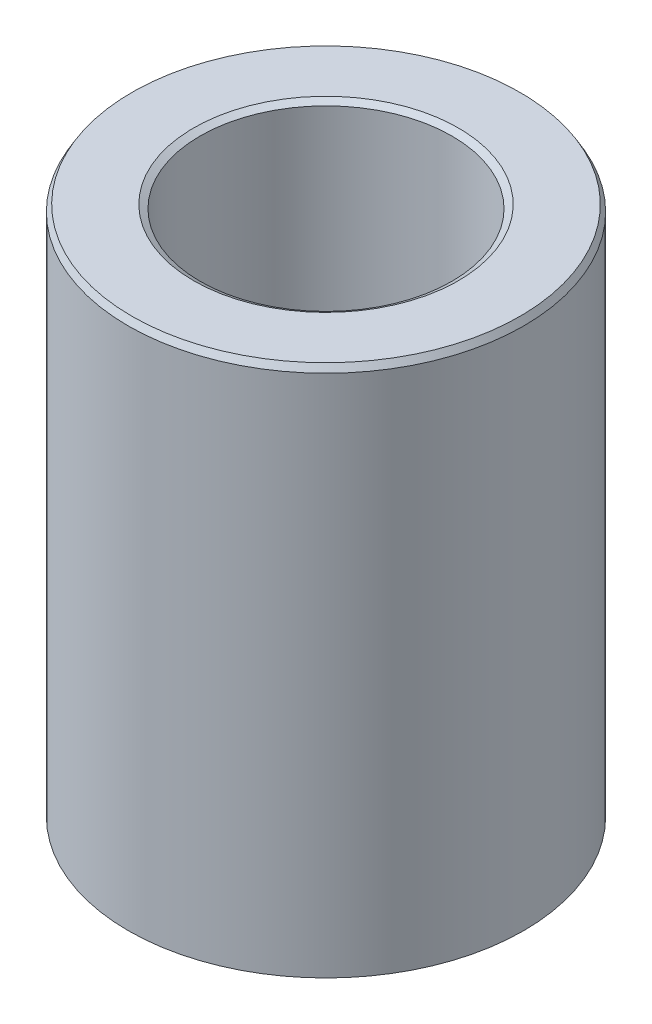
ISO-10303-21;
HEADER;
FILE_DESCRIPTION(('STEP AP214'),'2;1');
FILE_NAME('part.step','',(''),(''),'','','');
FILE_SCHEMA(('AUTOMOTIVE_DESIGN { 1 0 10303 214 1 1 1 1 }'));
ENDSEC;
DATA;
#1=APPLICATION_CONTEXT('core data for automotive mechanical design processes');
#2=APPLICATION_PROTOCOL_DEFINITION('international standard','automotive_design',2000,#1);
#3=PRODUCT_CONTEXT('',#1,'mechanical');
#4=PRODUCT('Part','Part','',(#3));
#5=PRODUCT_RELATED_PRODUCT_CATEGORY('part','',(#4));
#6=PRODUCT_DEFINITION_FORMATION('','',#4);
#7=PRODUCT_DEFINITION_CONTEXT('part definition',#1,'design');
#8=PRODUCT_DEFINITION('design','',#6,#7);
#9=PRODUCT_DEFINITION_SHAPE('','',#8);
#10=(LENGTH_UNIT() NAMED_UNIT(*) SI_UNIT(.MILLI.,.METRE.));
#11=(NAMED_UNIT(*) PLANE_ANGLE_UNIT() SI_UNIT($,.RADIAN.));
#12=(NAMED_UNIT(*) SI_UNIT($,.STERADIAN.) SOLID_ANGLE_UNIT());
#13=UNCERTAINTY_MEASURE_WITH_UNIT(LENGTH_MEASURE(1.E-05),#10,'distance_accuracy_value','');
#14=(GEOMETRIC_REPRESENTATION_CONTEXT(3) GLOBAL_UNCERTAINTY_ASSIGNED_CONTEXT((#13)) GLOBAL_UNIT_ASSIGNED_CONTEXT((#10,
#11,#12)) REPRESENTATION_CONTEXT('',''));
#15=CARTESIAN_POINT('',(0.,0.,0.));
#16=DIRECTION('',(0.,0.,1.));
#17=DIRECTION('',(1.,0.,0.));
#18=AXIS2_PLACEMENT_3D('',#15,#16,#17);
#19=CARTESIAN_POINT('',(0.,155.263865833454,0.));
#20=DIRECTION('',(0.,-1.,0.));
#21=DIRECTION('',(0.,0.,-1.));
#22=AXIS2_PLACEMENT_3D('',#19,#20,#21);
#23=CYLINDRICAL_SURFACE('',#22,57.5);
#24=CARTESIAN_POINT('',(0.,1.08624945352614,0.));
#25=DIRECTION('',(0.,1.,0.));
#26=DIRECTION('',(0.,0.,1.));
#27=AXIS2_PLACEMENT_3D('',#24,#25,#26);
#28=CIRCLE('',#27,57.5);
#29=CARTESIAN_POINT('',(0.,1.08624945352614,57.5));
#30=VERTEX_POINT('',#29);
#31=EDGE_CURVE('E10',#30,#30,#28,.T.);
#32=ORIENTED_EDGE('',*,*,#31,.T.);
#33=EDGE_LOOP('',(#32));
#34=FACE_BOUND('',#33,.T.);
#35=CARTESIAN_POINT('',(0.,153.382426590253,0.));
#36=DIRECTION('',(0.,1.,0.));
#37=DIRECTION('',(0.,0.,1.));
#38=AXIS2_PLACEMENT_3D('',#35,#36,#37);
#39=CIRCLE('',#38,57.5);
#40=CARTESIAN_POINT('',(0.,153.382426590253,57.5));
#41=VERTEX_POINT('',#40);
#42=EDGE_CURVE('E50',#41,#41,#39,.F.);
#43=ORIENTED_EDGE('',*,*,#42,.T.);
#44=EDGE_LOOP('',(#43));
#45=FACE_BOUND('',#44,.T.);
#46=ADVANCED_FACE('F39',(#34,#45),#23,.T.);
#47=CARTESIAN_POINT('',(0.,155.263865833454,0.));
#48=DIRECTION('',(0.,1.,0.));
#49=DIRECTION('',(0.,0.,1.));
#50=AXIS2_PLACEMENT_3D('',#47,#48,#49);
#51=PLANE('',#50);
#52=CARTESIAN_POINT('',(0.,155.263865833454,0.));
#53=DIRECTION('',(0.,1.,0.));
#54=DIRECTION('',(0.,0.,1.));
#55=AXIS2_PLACEMENT_3D('',#52,#53,#54);
#56=CIRCLE('',#55,38.4941172316721);
#57=CARTESIAN_POINT('',(0.,155.263865833454,38.4941172316721));
#58=VERTEX_POINT('',#57);
#59=EDGE_CURVE('E58',#58,#58,#56,.F.);
#60=ORIENTED_EDGE('',*,*,#59,.T.);
#61=EDGE_LOOP('',(#60));
#62=FACE_BOUND('',#61,.T.);
#63=CARTESIAN_POINT('',(0.,155.263865833454,0.));
#64=DIRECTION('',(0.,1.,0.));
#65=DIRECTION('',(0.,0.,1.));
#66=AXIS2_PLACEMENT_3D('',#63,#64,#65);
#67=CIRCLE('',#66,56.4137505464739);
#68=CARTESIAN_POINT('',(0.,155.263865833454,56.4137505464739));
#69=VERTEX_POINT('',#68);
#70=EDGE_CURVE('E61',#69,#69,#67,.T.);
#71=ORIENTED_EDGE('',*,*,#70,.T.);
#72=EDGE_LOOP('',(#71));
#73=FACE_BOUND('',#72,.T.);
#74=ADVANCED_FACE('F88',(#62,#73),#51,.T.);
#75=CARTESIAN_POINT('',(0.,0.,0.));
#76=DIRECTION('',(0.,1.,0.));
#77=DIRECTION('',(0.,0.,1.));
#78=AXIS2_PLACEMENT_3D('',#75,#76,#77);
#79=PLANE('',#78);
#80=CARTESIAN_POINT('',(0.,0.,0.));
#81=DIRECTION('',(0.,1.,0.));
#82=DIRECTION('',(0.,0.,1.));
#83=AXIS2_PLACEMENT_3D('',#80,#81,#82);
#84=CIRCLE('',#83,37.6989274419969);
#85=CARTESIAN_POINT('',(0.,0.,37.6989274419969));
#86=VERTEX_POINT('',#85);
#87=EDGE_CURVE('E51',#86,#86,#84,.T.);
#88=ORIENTED_EDGE('',*,*,#87,.T.);
#89=EDGE_LOOP('',(#88));
#90=FACE_BOUND('',#89,.T.);
#91=CARTESIAN_POINT('',(0.,0.,0.));
#92=DIRECTION('',(0.,1.,0.));
#93=DIRECTION('',(0.,0.,1.));
#94=AXIS2_PLACEMENT_3D('',#91,#92,#93);
#95=CIRCLE('',#94,55.6185607567987);
#96=CARTESIAN_POINT('',(0.,0.,55.6185607567987));
#97=VERTEX_POINT('',#96);
#98=EDGE_CURVE('E54',#97,#97,#95,.F.);
#99=ORIENTED_EDGE('',*,*,#98,.T.);
#100=EDGE_LOOP('',(#99));
#101=FACE_BOUND('',#100,.T.);
#102=ADVANCED_FACE('F83',(#90,#101),#79,.F.);
#103=CARTESIAN_POINT('',(0.,155.263865833454,0.));
#104=DIRECTION('',(0.,-1.,0.));
#105=DIRECTION('',(0.,0.,-1.));
#106=AXIS2_PLACEMENT_3D('',#103,#104,#105);
#107=CYLINDRICAL_SURFACE('',#106,36.6126779884707);
#108=CARTESIAN_POINT('',(0.,154.177616379928,0.));
#109=DIRECTION('',(0.,1.,0.));
#110=DIRECTION('',(0.,0.,1.));
#111=AXIS2_PLACEMENT_3D('',#108,#109,#110);
#112=CIRCLE('',#111,36.6126779884707);
#113=CARTESIAN_POINT('',(0.,154.177616379928,36.6126779884707));
#114=VERTEX_POINT('',#113);
#115=EDGE_CURVE('E67',#114,#114,#112,.T.);
#116=ORIENTED_EDGE('',*,*,#115,.T.);
#117=EDGE_LOOP('',(#116));
#118=FACE_BOUND('',#117,.T.);
#119=CARTESIAN_POINT('',(0.,1.88143924320125,0.));
#120=DIRECTION('',(0.,1.,0.));
#121=DIRECTION('',(0.,0.,1.));
#122=AXIS2_PLACEMENT_3D('',#119,#120,#121);
#123=CIRCLE('',#122,36.6126779884707);
#124=CARTESIAN_POINT('',(0.,1.88143924320125,36.6126779884707));
#125=VERTEX_POINT('',#124);
#126=EDGE_CURVE('E69',#125,#125,#123,.F.);
#127=ORIENTED_EDGE('',*,*,#126,.T.);
#128=EDGE_LOOP('',(#127));
#129=FACE_BOUND('',#128,.T.);
#130=ADVANCED_FACE('F71',(#118,#129),#107,.F.);
#131=CARTESIAN_POINT('',(0.,154.177616379928,0.));
#132=DIRECTION('',(0.,1.,0.));
#133=DIRECTION('',(0.,0.,1.));
#134=AXIS2_PLACEMENT_3D('',#131,#132,#133);
#135=CONICAL_SURFACE('',#134,36.6126779884707,1.0471975511966);
#136=ORIENTED_EDGE('',*,*,#59,.F.);
#137=EDGE_LOOP('',(#136));
#138=FACE_BOUND('',#137,.T.);
#139=ORIENTED_EDGE('',*,*,#115,.F.);
#140=EDGE_LOOP('',(#139));
#141=FACE_BOUND('',#140,.T.);
#142=ADVANCED_FACE('F77',(#138,#141),#135,.F.);
#143=CARTESIAN_POINT('',(0.,0.,0.));
#144=DIRECTION('',(0.,-1.,0.));
#145=DIRECTION('',(0.,0.,-1.));
#146=AXIS2_PLACEMENT_3D('',#143,#144,#145);
#147=CONICAL_SURFACE('',#146,37.6989274419969,0.523598775598298);
#148=ORIENTED_EDGE('',*,*,#126,.F.);
#149=EDGE_LOOP('',(#148));
#150=FACE_BOUND('',#149,.T.);
#151=ORIENTED_EDGE('',*,*,#87,.F.);
#152=EDGE_LOOP('',(#151));
#153=FACE_BOUND('',#152,.T.);
#154=ADVANCED_FACE('F73',(#150,#153),#147,.F.);
#155=CARTESIAN_POINT('',(0.,1.08624945352614,0.));
#156=DIRECTION('',(0.,1.,0.));
#157=DIRECTION('',(0.,0.,1.));
#158=AXIS2_PLACEMENT_3D('',#155,#156,#157);
#159=CONICAL_SURFACE('',#158,57.5,1.04719755119661);
#160=ORIENTED_EDGE('',*,*,#98,.F.);
#161=EDGE_LOOP('',(#160));
#162=FACE_BOUND('',#161,.T.);
#163=ORIENTED_EDGE('',*,*,#31,.F.);
#164=EDGE_LOOP('',(#163));
#165=FACE_BOUND('',#164,.T.);
#166=ADVANCED_FACE('F76',(#162,#165),#159,.T.);
#167=CARTESIAN_POINT('',(0.,155.263865833454,0.));
#168=DIRECTION('',(0.,-1.,0.));
#169=DIRECTION('',(0.,0.,-1.));
#170=AXIS2_PLACEMENT_3D('',#167,#168,#169);
#171=CONICAL_SURFACE('',#170,56.4137505464739,0.5235987755983);
#172=ORIENTED_EDGE('',*,*,#42,.F.);
#173=EDGE_LOOP('',(#172));
#174=FACE_BOUND('',#173,.T.);
#175=ORIENTED_EDGE('',*,*,#70,.F.);
#176=EDGE_LOOP('',(#175));
#177=FACE_BOUND('',#176,.T.);
#178=ADVANCED_FACE('F45',(#174,#177),#171,.T.);
#179=CLOSED_SHELL('',(#46,#74,#102,#130,#142,#154,#166,#178));
#180=MANIFOLD_SOLID_BREP('B2',#179);
#181=ADVANCED_BREP_SHAPE_REPRESENTATION('',(#18,#180),#14);
#182=SHAPE_DEFINITION_REPRESENTATION(#9,#181);
ENDSEC;
END-ISO-10303-21;
